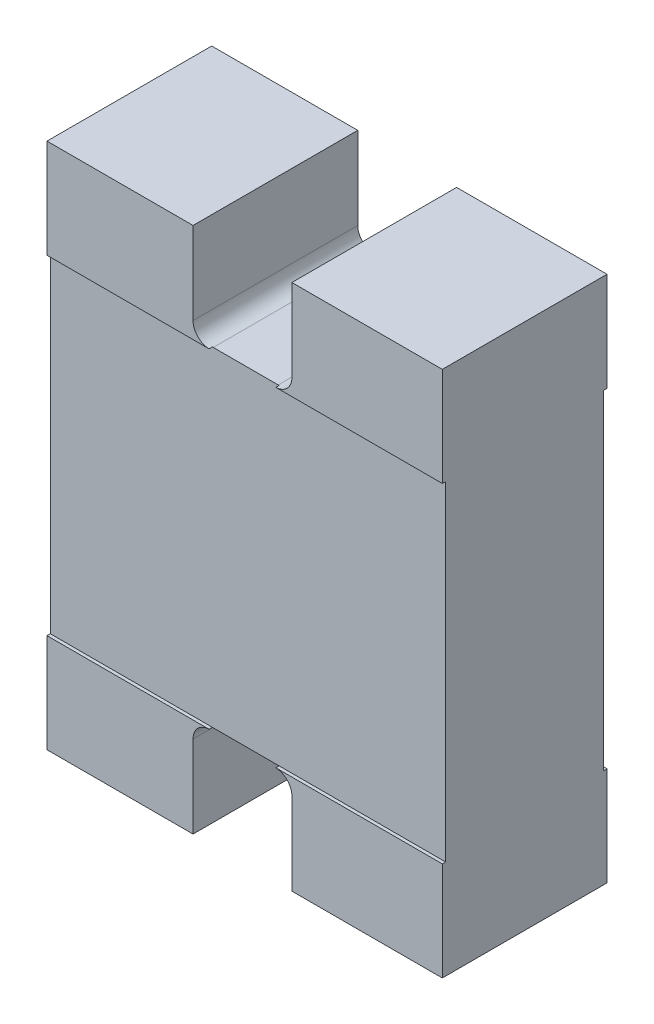
ISO-10303-21;
HEADER;
FILE_DESCRIPTION(('STEP AP214'),'2;1');
FILE_NAME('part.step','',(''),(''),'','','');
FILE_SCHEMA(('AUTOMOTIVE_DESIGN { 1 0 10303 214 1 1 1 1 }'));
ENDSEC;
DATA;
#1=APPLICATION_CONTEXT('core data for automotive mechanical design processes');
#2=APPLICATION_PROTOCOL_DEFINITION('international standard','automotive_design',2000,#1);
#3=PRODUCT_CONTEXT('',#1,'mechanical');
#4=PRODUCT('Part','Part','',(#3));
#5=PRODUCT_RELATED_PRODUCT_CATEGORY('part','',(#4));
#6=PRODUCT_DEFINITION_FORMATION('','',#4);
#7=PRODUCT_DEFINITION_CONTEXT('part definition',#1,'design');
#8=PRODUCT_DEFINITION('design','',#6,#7);
#9=PRODUCT_DEFINITION_SHAPE('','',#8);
#10=(LENGTH_UNIT() NAMED_UNIT(*) SI_UNIT(.MILLI.,.METRE.));
#11=(NAMED_UNIT(*) PLANE_ANGLE_UNIT() SI_UNIT($,.RADIAN.));
#12=(NAMED_UNIT(*) SI_UNIT($,.STERADIAN.) SOLID_ANGLE_UNIT());
#13=UNCERTAINTY_MEASURE_WITH_UNIT(LENGTH_MEASURE(1.E-05),#10,'distance_accuracy_value','');
#14=(GEOMETRIC_REPRESENTATION_CONTEXT(3) GLOBAL_UNCERTAINTY_ASSIGNED_CONTEXT((#13)) GLOBAL_UNIT_ASSIGNED_CONTEXT((#10,
#11,#12)) REPRESENTATION_CONTEXT('',''));
#15=CARTESIAN_POINT('',(0.,0.,0.));
#16=DIRECTION('',(0.,0.,1.));
#17=DIRECTION('',(1.,0.,0.));
#18=AXIS2_PLACEMENT_3D('',#15,#16,#17);
#19=CARTESIAN_POINT('',(0.,0.,0.5));
#20=DIRECTION('',(0.,0.,1.));
#21=DIRECTION('',(1.,0.,0.));
#22=AXIS2_PLACEMENT_3D('',#19,#20,#21);
#23=PLANE('',#22);
#24=DIRECTION('',(0.,1.,0.));
#25=VECTOR('',#24,1.);
#26=CARTESIAN_POINT('',(0.6,0.8,0.5));
#27=LINE('',#26,#25);
#28=CARTESIAN_POINT('',(0.6,-0.8,0.5));
#29=VERTEX_POINT('',#28);
#30=CARTESIAN_POINT('',(0.6,-0.500000000000838,0.5));
#31=VERTEX_POINT('',#30);
#32=EDGE_CURVE('E399',#29,#31,#27,.T.);
#33=ORIENTED_EDGE('',*,*,#32,.T.);
#34=DIRECTION('',(-1.,0.,0.));
#35=VECTOR('',#34,1.);
#36=CARTESIAN_POINT('',(0.6,-0.500000000000838,0.5));
#37=LINE('',#36,#35);
#38=CARTESIAN_POINT('',(0.0947676380211681,-0.500000000000838,0.5));
#39=VERTEX_POINT('',#38);
#40=EDGE_CURVE('E536',#31,#39,#37,.T.);
#41=ORIENTED_EDGE('',*,*,#40,.T.);
#42=CARTESIAN_POINT('',(0.0933814284328622,-0.549979938272866,0.5));
#43=DIRECTION('',(0.,0.,1.));
#44=DIRECTION('',(-1.,0.,0.));
#45=AXIS2_PLACEMENT_3D('',#42,#43,#44);
#46=CIRCLE('',#45,0.0499991580598961);
#47=CARTESIAN_POINT('',(0.143380586492758,-0.549979938272866,0.5));
#48=VERTEX_POINT('',#47);
#49=EDGE_CURVE('E527',#48,#39,#46,.T.);
#50=ORIENTED_EDGE('',*,*,#49,.F.);
#51=DIRECTION('',(-1.05897102086358E-06,0.999999999999439,0.));
#52=VECTOR('',#51,1.);
#53=CARTESIAN_POINT('',(0.143380851256758,-0.8,0.5));
#54=LINE('',#53,#52);
#55=CARTESIAN_POINT('',(0.143380851256758,-0.8,0.5));
#56=VERTEX_POINT('',#55);
#57=EDGE_CURVE('E121',#56,#48,#54,.T.);
#58=ORIENTED_EDGE('',*,*,#57,.F.);
#59=DIRECTION('',(1.,0.,0.));
#60=VECTOR('',#59,1.);
#61=CARTESIAN_POINT('',(-0.6,-0.8,0.5));
#62=LINE('',#61,#60);
#63=EDGE_CURVE('E408',#56,#29,#62,.T.);
#64=ORIENTED_EDGE('',*,*,#63,.T.);
#65=EDGE_LOOP('',(#33,#41,#50,#58,#64));
#66=FACE_BOUND('',#65,.T.);
#67=ADVANCED_FACE('F36',(#66),#23,.T.);
#68=CARTESIAN_POINT('',(-0.106619990683346,-0.549979938272866,0.5));
#69=DIRECTION('',(0.,0.,1.));
#70=DIRECTION('',(1.,0.,0.));
#71=AXIS2_PLACEMENT_3D('',#68,#69,#70);
#72=CIRCLE('',#71,0.0499991580598962);
#73=CARTESIAN_POINT('',(-0.108006200271658,-0.500000000000838,0.5));
#74=VERTEX_POINT('',#73);
#75=CARTESIAN_POINT('',(-0.156619148743242,-0.549979938272866,0.5));
#76=VERTEX_POINT('',#75);
#77=EDGE_CURVE('E525',#74,#76,#72,.T.);
#78=ORIENTED_EDGE('',*,*,#77,.F.);
#79=CARTESIAN_POINT('',(-0.6,-0.500000000000838,0.5));
#80=VERTEX_POINT('',#79);
#81=EDGE_CURVE('E422',#74,#80,#37,.T.);
#82=ORIENTED_EDGE('',*,*,#81,.T.);
#83=DIRECTION('',(0.,-1.,0.));
#84=VECTOR('',#83,1.);
#85=CARTESIAN_POINT('',(-0.6,0.8,0.5));
#86=LINE('',#85,#84);
#87=CARTESIAN_POINT('',(-0.6,-0.8,0.5));
#88=VERTEX_POINT('',#87);
#89=EDGE_CURVE('E405',#80,#88,#86,.T.);
#90=ORIENTED_EDGE('',*,*,#89,.T.);
#91=CARTESIAN_POINT('',(-0.156619148743242,-0.8,0.5));
#92=VERTEX_POINT('',#91);
#93=EDGE_CURVE('E193',#88,#92,#62,.T.);
#94=ORIENTED_EDGE('',*,*,#93,.T.);
#95=DIRECTION('',(0.,-1.,0.));
#96=VECTOR('',#95,1.);
#97=CARTESIAN_POINT('',(-0.156619148743242,-0.8,0.5));
#98=LINE('',#97,#96);
#99=EDGE_CURVE('E138',#76,#92,#98,.T.);
#100=ORIENTED_EDGE('',*,*,#99,.F.);
#101=EDGE_LOOP('',(#78,#82,#90,#94,#100));
#102=FACE_BOUND('',#101,.T.);
#103=ADVANCED_FACE('F418',(#102),#23,.T.);
#104=CARTESIAN_POINT('',(-0.6,0.8,0.5));
#105=VERTEX_POINT('',#104);
#106=CARTESIAN_POINT('',(-0.6,0.500000000000838,0.5));
#107=VERTEX_POINT('',#106);
#108=EDGE_CURVE('E406',#105,#107,#86,.T.);
#109=ORIENTED_EDGE('',*,*,#108,.T.);
#110=DIRECTION('',(1.,0.,0.));
#111=VECTOR('',#110,1.);
#112=CARTESIAN_POINT('',(0.6,0.500000000000838,0.5));
#113=LINE('',#112,#111);
#114=CARTESIAN_POINT('',(-0.108006200271662,0.500000000000838,0.5));
#115=VERTEX_POINT('',#114);
#116=EDGE_CURVE('E351',#107,#115,#113,.T.);
#117=ORIENTED_EDGE('',*,*,#116,.T.);
#118=CARTESIAN_POINT('',(-0.106619990683346,0.549979938272866,0.5));
#119=DIRECTION('',(0.,0.,-1.));
#120=DIRECTION('',(1.,0.,0.));
#121=AXIS2_PLACEMENT_3D('',#118,#119,#120);
#122=CIRCLE('',#121,0.0499991580598962);
#123=CARTESIAN_POINT('',(-0.156619148743242,0.549979938272866,0.5));
#124=VERTEX_POINT('',#123);
#125=EDGE_CURVE('E358',#115,#124,#122,.T.);
#126=ORIENTED_EDGE('',*,*,#125,.T.);
#127=DIRECTION('',(0.,1.,0.));
#128=VECTOR('',#127,1.);
#129=CARTESIAN_POINT('',(-0.156619148743242,0.8,0.5));
#130=LINE('',#129,#128);
#131=CARTESIAN_POINT('',(-0.156619148743242,0.8,0.5));
#132=VERTEX_POINT('',#131);
#133=EDGE_CURVE('E361',#124,#132,#130,.T.);
#134=ORIENTED_EDGE('',*,*,#133,.T.);
#135=DIRECTION('',(-1.,0.,0.));
#136=VECTOR('',#135,1.);
#137=CARTESIAN_POINT('',(-0.6,0.8,0.5));
#138=LINE('',#137,#136);
#139=EDGE_CURVE('E402',#132,#105,#138,.T.);
#140=ORIENTED_EDGE('',*,*,#139,.T.);
#141=EDGE_LOOP('',(#109,#117,#126,#134,#140));
#142=FACE_BOUND('',#141,.T.);
#143=ADVANCED_FACE('F613',(#142),#23,.T.);
#144=CARTESIAN_POINT('',(0.0933814284328622,0.549979938272866,0.5));
#145=DIRECTION('',(0.,0.,-1.));
#146=DIRECTION('',(-1.,0.,0.));
#147=AXIS2_PLACEMENT_3D('',#144,#145,#146);
#148=CIRCLE('',#147,0.0499991580598961);
#149=CARTESIAN_POINT('',(0.143380586492758,0.549979938272866,0.5));
#150=VERTEX_POINT('',#149);
#151=CARTESIAN_POINT('',(0.0947676380211722,0.500000000000838,0.5));
#152=VERTEX_POINT('',#151);
#153=EDGE_CURVE('E362',#150,#152,#148,.T.);
#154=ORIENTED_EDGE('',*,*,#153,.T.);
#155=CARTESIAN_POINT('',(0.6,0.500000000000838,0.5));
#156=VERTEX_POINT('',#155);
#157=EDGE_CURVE('E348',#152,#156,#113,.T.);
#158=ORIENTED_EDGE('',*,*,#157,.T.);
#159=CARTESIAN_POINT('',(0.6,0.8,0.5));
#160=VERTEX_POINT('',#159);
#161=EDGE_CURVE('E184',#156,#160,#27,.T.);
#162=ORIENTED_EDGE('',*,*,#161,.T.);
#163=CARTESIAN_POINT('',(0.143380851256758,0.8,0.5));
#164=VERTEX_POINT('',#163);
#165=EDGE_CURVE('E403',#160,#164,#138,.T.);
#166=ORIENTED_EDGE('',*,*,#165,.T.);
#167=DIRECTION('',(-1.05897102086358E-06,-0.999999999999439,0.));
#168=VECTOR('',#167,1.);
#169=CARTESIAN_POINT('',(0.143380851256758,0.8,0.5));
#170=LINE('',#169,#168);
#171=EDGE_CURVE('E232',#164,#150,#170,.T.);
#172=ORIENTED_EDGE('',*,*,#171,.T.);
#173=EDGE_LOOP('',(#154,#158,#162,#166,#172));
#174=FACE_BOUND('',#173,.T.);
#175=ADVANCED_FACE('F610',(#174),#23,.T.);
#176=CARTESIAN_POINT('',(0.091995218874762,0.5,0.5));
#177=DIRECTION('',(0.,-1.,0.));
#178=DIRECTION('',(0.,0.,-1.));
#179=AXIS2_PLACEMENT_3D('',#176,#177,#178);
#180=PLANE('',#179);
#181=DIRECTION('',(1.,0.,0.));
#182=VECTOR('',#181,1.);
#183=CARTESIAN_POINT('',(0.6,0.500000000000838,0.49));
#184=LINE('',#183,#182);
#185=CARTESIAN_POINT('',(-0.105233781110134,0.500000000000419,0.49));
#186=VERTEX_POINT('',#185);
#187=CARTESIAN_POINT('',(0.0919952188596571,0.500000000000419,0.49));
#188=VERTEX_POINT('',#187);
#189=EDGE_CURVE('E384',#186,#188,#184,.T.);
#190=ORIENTED_EDGE('',*,*,#189,.T.);
#191=DIRECTION('',(0.,0.,-1.));
#192=VECTOR('',#191,1.);
#193=CARTESIAN_POINT('',(0.091995218874762,0.5,0.5));
#194=LINE('',#193,#192);
#195=CARTESIAN_POINT('',(0.0919952188596571,0.500000000000419,0.01));
#196=VERTEX_POINT('',#195);
#197=EDGE_CURVE('E386',#188,#196,#194,.T.);
#198=ORIENTED_EDGE('',*,*,#197,.T.);
#199=DIRECTION('',(1.,0.,0.));
#200=VECTOR('',#199,1.);
#201=CARTESIAN_POINT('',(0.6,0.500000000000838,0.01));
#202=LINE('',#201,#200);
#203=CARTESIAN_POINT('',(-0.105233781110134,0.500000000000419,0.01));
#204=VERTEX_POINT('',#203);
#205=EDGE_CURVE('E256',#204,#196,#202,.T.);
#206=ORIENTED_EDGE('',*,*,#205,.F.);
#207=DIRECTION('',(0.,0.,-1.));
#208=VECTOR('',#207,1.);
#209=CARTESIAN_POINT('',(-0.105233781125238,0.5,0.5));
#210=LINE('',#209,#208);
#211=EDGE_CURVE('E377',#186,#204,#210,.T.);
#212=ORIENTED_EDGE('',*,*,#211,.F.);
#213=EDGE_LOOP('',(#190,#198,#206,#212));
#214=FACE_BOUND('',#213,.T.);
#215=ADVANCED_FACE('F382',(#214),#180,.F.);
#216=CARTESIAN_POINT('',(0.6,0.8,0.5));
#217=DIRECTION('',(-1.,0.,0.));
#218=DIRECTION('',(0.,-1.,0.));
#219=AXIS2_PLACEMENT_3D('',#216,#217,#218);
#220=PLANE('',#219);
#221=DIRECTION('',(0.,0.,1.));
#222=VECTOR('',#221,1.);
#223=CARTESIAN_POINT('',(0.6,-0.500000000000838,0.49));
#224=LINE('',#223,#222);
#225=CARTESIAN_POINT('',(0.6,-0.500000000000838,0.49));
#226=VERTEX_POINT('',#225);
#227=EDGE_CURVE('E367',#226,#31,#224,.T.);
#228=ORIENTED_EDGE('',*,*,#227,.T.);
#229=ORIENTED_EDGE('',*,*,#32,.F.);
#230=DIRECTION('',(0.,0.,-1.));
#231=VECTOR('',#230,1.);
#232=CARTESIAN_POINT('',(0.6,-0.8,0.5));
#233=LINE('',#232,#231);
#234=CARTESIAN_POINT('',(0.6,-0.8,0.));
#235=VERTEX_POINT('',#234);
#236=EDGE_CURVE('E190',#29,#235,#233,.T.);
#237=ORIENTED_EDGE('',*,*,#236,.T.);
#238=DIRECTION('',(0.,1.,0.));
#239=VECTOR('',#238,1.);
#240=CARTESIAN_POINT('',(0.6,0.8,0.));
#241=LINE('',#240,#239);
#242=CARTESIAN_POINT('',(0.6,-0.500000000000838,0.));
#243=VERTEX_POINT('',#242);
#244=EDGE_CURVE('E174',#235,#243,#241,.T.);
#245=ORIENTED_EDGE('',*,*,#244,.T.);
#246=DIRECTION('',(0.,0.,-1.));
#247=VECTOR('',#246,1.);
#248=CARTESIAN_POINT('',(0.6,-0.500000000000838,0.01));
#249=LINE('',#248,#247);
#250=CARTESIAN_POINT('',(0.6,-0.500000000000838,0.01));
#251=VERTEX_POINT('',#250);
#252=EDGE_CURVE('E248',#251,#243,#249,.T.);
#253=ORIENTED_EDGE('',*,*,#252,.F.);
#254=DIRECTION('',(0.,-1.,0.));
#255=VECTOR('',#254,1.);
#256=CARTESIAN_POINT('',(0.6,0.500000000000838,0.01));
#257=LINE('',#256,#255);
#258=CARTESIAN_POINT('',(0.6,0.500000000000838,0.01));
#259=VERTEX_POINT('',#258);
#260=EDGE_CURVE('E231',#259,#251,#257,.T.);
#261=ORIENTED_EDGE('',*,*,#260,.F.);
#262=DIRECTION('',(0.,0.,-1.));
#263=VECTOR('',#262,1.);
#264=CARTESIAN_POINT('',(0.6,0.500000000000838,0.01));
#265=LINE('',#264,#263);
#266=CARTESIAN_POINT('',(0.6,0.500000000000838,0.));
#267=VERTEX_POINT('',#266);
#268=EDGE_CURVE('E239',#259,#267,#265,.T.);
#269=ORIENTED_EDGE('',*,*,#268,.T.);
#270=CARTESIAN_POINT('',(0.6,0.8,0.));
#271=VERTEX_POINT('',#270);
#272=EDGE_CURVE('E295',#267,#271,#241,.T.);
#273=ORIENTED_EDGE('',*,*,#272,.T.);
#274=DIRECTION('',(0.,0.,-1.));
#275=VECTOR('',#274,1.);
#276=CARTESIAN_POINT('',(0.6,0.8,0.5));
#277=LINE('',#276,#275);
#278=EDGE_CURVE('E199',#160,#271,#277,.T.);
#279=ORIENTED_EDGE('',*,*,#278,.F.);
#280=ORIENTED_EDGE('',*,*,#161,.F.);
#281=DIRECTION('',(0.,0.,1.));
#282=VECTOR('',#281,1.);
#283=CARTESIAN_POINT('',(0.6,0.500000000000838,0.49));
#284=LINE('',#283,#282);
#285=CARTESIAN_POINT('',(0.6,0.500000000000838,0.49));
#286=VERTEX_POINT('',#285);
#287=EDGE_CURVE('E547',#286,#156,#284,.T.);
#288=ORIENTED_EDGE('',*,*,#287,.F.);
#289=DIRECTION('',(0.,-1.,0.));
#290=VECTOR('',#289,1.);
#291=CARTESIAN_POINT('',(0.6,0.500000000000838,0.49));
#292=LINE('',#291,#290);
#293=EDGE_CURVE('E538',#286,#226,#292,.T.);
#294=ORIENTED_EDGE('',*,*,#293,.T.);
#295=EDGE_LOOP('',(#228,#229,#237,#245,#253,#261,#269,#273,#279,#280,#288,#294));
#296=FACE_BOUND('',#295,.T.);
#297=ADVANCED_FACE('F38',(#296),#220,.F.);
#298=CARTESIAN_POINT('',(-0.6,0.8,0.5));
#299=DIRECTION('',(1.,0.,0.));
#300=DIRECTION('',(0.,1.,0.));
#301=AXIS2_PLACEMENT_3D('',#298,#299,#300);
#302=PLANE('',#301);
#303=DIRECTION('',(0.,0.,1.));
#304=VECTOR('',#303,1.);
#305=CARTESIAN_POINT('',(-0.6,-0.500000000000838,0.49));
#306=LINE('',#305,#304);
#307=CARTESIAN_POINT('',(-0.6,-0.500000000000838,0.49));
#308=VERTEX_POINT('',#307);
#309=EDGE_CURVE('E429',#308,#80,#306,.T.);
#310=ORIENTED_EDGE('',*,*,#309,.F.);
#311=DIRECTION('',(0.,1.,0.));
#312=VECTOR('',#311,1.);
#313=CARTESIAN_POINT('',(-0.6,0.500000000000838,0.49));
#314=LINE('',#313,#312);
#315=CARTESIAN_POINT('',(-0.6,0.500000000000838,0.49));
#316=VERTEX_POINT('',#315);
#317=EDGE_CURVE('E558',#308,#316,#314,.T.);
#318=ORIENTED_EDGE('',*,*,#317,.T.);
#319=DIRECTION('',(0.,0.,1.));
#320=VECTOR('',#319,1.);
#321=CARTESIAN_POINT('',(-0.6,0.500000000000838,0.49));
#322=LINE('',#321,#320);
#323=EDGE_CURVE('E545',#316,#107,#322,.T.);
#324=ORIENTED_EDGE('',*,*,#323,.T.);
#325=ORIENTED_EDGE('',*,*,#108,.F.);
#326=DIRECTION('',(0.,0.,-1.));
#327=VECTOR('',#326,1.);
#328=CARTESIAN_POINT('',(-0.6,0.8,0.5));
#329=LINE('',#328,#327);
#330=CARTESIAN_POINT('',(-0.6,0.8,0.));
#331=VERTEX_POINT('',#330);
#332=EDGE_CURVE('E196',#105,#331,#329,.T.);
#333=ORIENTED_EDGE('',*,*,#332,.T.);
#334=DIRECTION('',(0.,-1.,0.));
#335=VECTOR('',#334,1.);
#336=CARTESIAN_POINT('',(-0.6,0.8,0.));
#337=LINE('',#336,#335);
#338=CARTESIAN_POINT('',(-0.6,0.500000000000838,0.));
#339=VERTEX_POINT('',#338);
#340=EDGE_CURVE('E181',#331,#339,#337,.T.);
#341=ORIENTED_EDGE('',*,*,#340,.T.);
#342=DIRECTION('',(0.,0.,-1.));
#343=VECTOR('',#342,1.);
#344=CARTESIAN_POINT('',(-0.6,0.500000000000838,0.01));
#345=LINE('',#344,#343);
#346=CARTESIAN_POINT('',(-0.6,0.500000000000838,0.01));
#347=VERTEX_POINT('',#346);
#348=EDGE_CURVE('E243',#347,#339,#345,.T.);
#349=ORIENTED_EDGE('',*,*,#348,.F.);
#350=DIRECTION('',(0.,1.,0.));
#351=VECTOR('',#350,1.);
#352=CARTESIAN_POINT('',(-0.6,0.500000000000838,0.01));
#353=LINE('',#352,#351);
#354=CARTESIAN_POINT('',(-0.6,-0.500000000000838,0.01));
#355=VERTEX_POINT('',#354);
#356=EDGE_CURVE('E267',#355,#347,#353,.T.);
#357=ORIENTED_EDGE('',*,*,#356,.F.);
#358=DIRECTION('',(0.,0.,-1.));
#359=VECTOR('',#358,1.);
#360=CARTESIAN_POINT('',(-0.6,-0.500000000000838,0.01));
#361=LINE('',#360,#359);
#362=CARTESIAN_POINT('',(-0.6,-0.500000000000838,0.));
#363=VERTEX_POINT('',#362);
#364=EDGE_CURVE('E246',#355,#363,#361,.T.);
#365=ORIENTED_EDGE('',*,*,#364,.T.);
#366=CARTESIAN_POINT('',(-0.6,-0.8,0.));
#367=VERTEX_POINT('',#366);
#368=EDGE_CURVE('E186',#363,#367,#337,.T.);
#369=ORIENTED_EDGE('',*,*,#368,.T.);
#370=DIRECTION('',(0.,0.,-1.));
#371=VECTOR('',#370,1.);
#372=CARTESIAN_POINT('',(-0.6,-0.8,0.5));
#373=LINE('',#372,#371);
#374=EDGE_CURVE('E192',#88,#367,#373,.T.);
#375=ORIENTED_EDGE('',*,*,#374,.F.);
#376=ORIENTED_EDGE('',*,*,#89,.F.);
#377=EDGE_LOOP('',(#310,#318,#324,#325,#333,#341,#349,#357,#365,#369,#375,#376));
#378=FACE_BOUND('',#377,.T.);
#379=ADVANCED_FACE('F314',(#378),#302,.F.);
#380=CARTESIAN_POINT('',(-0.106619990683346,0.549979938272866,0.5));
#381=DIRECTION('',(0.,0.,-1.));
#382=DIRECTION('',(-1.,0.,0.));
#383=AXIS2_PLACEMENT_3D('',#380,#381,#382);
#384=CYLINDRICAL_SURFACE('',#383,0.0499991580598962);
#385=DIRECTION('',(0.,0.,-1.));
#386=VECTOR('',#385,1.);
#387=CARTESIAN_POINT('',(-0.108006200271662,0.500000000000838,0.5));
#388=LINE('',#387,#386);
#389=CARTESIAN_POINT('',(-0.108006200271662,0.500000000000838,0.49));
#390=VERTEX_POINT('',#389);
#391=EDGE_CURVE('E334',#390,#115,#388,.F.);
#392=ORIENTED_EDGE('',*,*,#391,.F.);
#393=CARTESIAN_POINT('',(-0.106619990683346,0.549979938272866,0.49));
#394=DIRECTION('',(0.,0.,-1.));
#395=DIRECTION('',(-1.,0.,0.));
#396=AXIS2_PLACEMENT_3D('',#393,#394,#395);
#397=CIRCLE('',#396,0.0499991580598962);
#398=EDGE_CURVE('E40',#390,#186,#397,.F.);
#399=ORIENTED_EDGE('',*,*,#398,.T.);
#400=ORIENTED_EDGE('',*,*,#211,.T.);
#401=CARTESIAN_POINT('',(-0.106619990683346,0.549979938272866,0.01));
#402=DIRECTION('',(0.,0.,-1.));
#403=DIRECTION('',(-1.,0.,0.));
#404=AXIS2_PLACEMENT_3D('',#401,#402,#403);
#405=CIRCLE('',#404,0.0499991580598962);
#406=CARTESIAN_POINT('',(-0.108006200271662,0.500000000000838,0.01));
#407=VERTEX_POINT('',#406);
#408=EDGE_CURVE('E224',#407,#204,#405,.F.);
#409=ORIENTED_EDGE('',*,*,#408,.F.);
#410=DIRECTION('',(0.,0.,-1.));
#411=VECTOR('',#410,1.);
#412=CARTESIAN_POINT('',(-0.108006200271662,0.500000000000838,0.5));
#413=LINE('',#412,#411);
#414=CARTESIAN_POINT('',(-0.108006200271662,0.500000000000838,0.));
#415=VERTEX_POINT('',#414);
#416=EDGE_CURVE('E220',#407,#415,#413,.T.);
#417=ORIENTED_EDGE('',*,*,#416,.T.);
#418=CARTESIAN_POINT('',(-0.106619990683346,0.549979938272866,0.));
#419=DIRECTION('',(0.,0.,-1.));
#420=DIRECTION('',(1.,0.,0.));
#421=AXIS2_PLACEMENT_3D('',#418,#419,#420);
#422=CIRCLE('',#421,0.0499991580598962);
#423=CARTESIAN_POINT('',(-0.156619148743242,0.549979938272866,0.));
#424=VERTEX_POINT('',#423);
#425=EDGE_CURVE('E212',#415,#424,#422,.T.);
#426=ORIENTED_EDGE('',*,*,#425,.T.);
#427=DIRECTION('',(0.,0.,-1.));
#428=VECTOR('',#427,1.);
#429=CARTESIAN_POINT('',(-0.156619148743242,0.549979938272866,0.5));
#430=LINE('',#429,#428);
#431=EDGE_CURVE('E385',#124,#424,#430,.T.);
#432=ORIENTED_EDGE('',*,*,#431,.F.);
#433=ORIENTED_EDGE('',*,*,#125,.F.);
#434=EDGE_LOOP('',(#392,#399,#400,#409,#417,#426,#432,#433));
#435=FACE_BOUND('',#434,.T.);
#436=ADVANCED_FACE('F375',(#435),#384,.F.);
#437=CARTESIAN_POINT('',(0.0933814284328622,0.549979938272866,0.5));
#438=DIRECTION('',(0.,0.,-1.));
#439=DIRECTION('',(-1.,0.,0.));
#440=AXIS2_PLACEMENT_3D('',#437,#438,#439);
#441=CYLINDRICAL_SURFACE('',#440,0.0499991580598961);
#442=DIRECTION('',(0.,0.,-1.));
#443=VECTOR('',#442,1.);
#444=CARTESIAN_POINT('',(0.0947676380211722,0.500000000000838,0.5));
#445=LINE('',#444,#443);
#446=CARTESIAN_POINT('',(0.0947676380211722,0.500000000000838,0.49));
#447=VERTEX_POINT('',#446);
#448=EDGE_CURVE('E11',#152,#447,#445,.T.);
#449=ORIENTED_EDGE('',*,*,#448,.F.);
#450=ORIENTED_EDGE('',*,*,#153,.F.);
#451=DIRECTION('',(0.,0.,-1.));
#452=VECTOR('',#451,1.);
#453=CARTESIAN_POINT('',(0.143380586492758,0.549979938272866,0.5));
#454=LINE('',#453,#452);
#455=CARTESIAN_POINT('',(0.143380586492758,0.549979938272866,0.));
#456=VERTEX_POINT('',#455);
#457=EDGE_CURVE('E390',#150,#456,#454,.T.);
#458=ORIENTED_EDGE('',*,*,#457,.T.);
#459=CARTESIAN_POINT('',(0.0933814284328622,0.549979938272866,0.));
#460=DIRECTION('',(0.,0.,-1.));
#461=DIRECTION('',(-1.,0.,0.));
#462=AXIS2_PLACEMENT_3D('',#459,#460,#461);
#463=CIRCLE('',#462,0.0499991580598961);
#464=CARTESIAN_POINT('',(0.0947676380211722,0.500000000000838,0.));
#465=VERTEX_POINT('',#464);
#466=EDGE_CURVE('E209',#456,#465,#463,.T.);
#467=ORIENTED_EDGE('',*,*,#466,.T.);
#468=DIRECTION('',(0.,0.,-1.));
#469=VECTOR('',#468,1.);
#470=CARTESIAN_POINT('',(0.0947676380211722,0.500000000000838,0.5));
#471=LINE('',#470,#469);
#472=CARTESIAN_POINT('',(0.0947676380211722,0.500000000000838,0.01));
#473=VERTEX_POINT('',#472);
#474=EDGE_CURVE('E205',#465,#473,#471,.F.);
#475=ORIENTED_EDGE('',*,*,#474,.T.);
#476=CARTESIAN_POINT('',(0.0933814284328622,0.549979938272866,0.01));
#477=DIRECTION('',(0.,0.,-1.));
#478=DIRECTION('',(-1.,0.,0.));
#479=AXIS2_PLACEMENT_3D('',#476,#477,#478);
#480=CIRCLE('',#479,0.0499991580598961);
#481=EDGE_CURVE('E202',#196,#473,#480,.F.);
#482=ORIENTED_EDGE('',*,*,#481,.F.);
#483=ORIENTED_EDGE('',*,*,#197,.F.);
#484=CARTESIAN_POINT('',(0.0933814284328622,0.549979938272866,0.49));
#485=DIRECTION('',(0.,0.,-1.));
#486=DIRECTION('',(-1.,0.,0.));
#487=AXIS2_PLACEMENT_3D('',#484,#485,#486);
#488=CIRCLE('',#487,0.0499991580598961);
#489=EDGE_CURVE('E366',#188,#447,#488,.F.);
#490=ORIENTED_EDGE('',*,*,#489,.T.);
#491=EDGE_LOOP('',(#449,#450,#458,#467,#475,#482,#483,#490));
#492=FACE_BOUND('',#491,.T.);
#493=ADVANCED_FACE('F815',(#492),#441,.F.);
#494=CARTESIAN_POINT('',(0.0933814284328622,-0.549979938272866,0.5));
#495=DIRECTION('',(0.,0.,-1.));
#496=DIRECTION('',(-1.,0.,0.));
#497=AXIS2_PLACEMENT_3D('',#494,#495,#496);
#498=CYLINDRICAL_SURFACE('',#497,0.0499991580598961);
#499=ORIENTED_EDGE('',*,*,#49,.T.);
#500=DIRECTION('',(0.,0.,-1.));
#501=VECTOR('',#500,1.);
#502=CARTESIAN_POINT('',(0.0947676380211681,-0.500000000000838,0.5));
#503=LINE('',#502,#501);
#504=CARTESIAN_POINT('',(0.0947676380211682,-0.500000000000838,0.49));
#505=VERTEX_POINT('',#504);
#506=EDGE_CURVE('E336',#39,#505,#503,.T.);
#507=ORIENTED_EDGE('',*,*,#506,.T.);
#508=CARTESIAN_POINT('',(0.0933814284328622,-0.549979938272866,0.49));
#509=DIRECTION('',(0.,0.,-1.));
#510=DIRECTION('',(-1.,0.,0.));
#511=AXIS2_PLACEMENT_3D('',#508,#509,#510);
#512=CIRCLE('',#511,0.0499991580598961);
#513=CARTESIAN_POINT('',(0.0919952188596591,-0.500000000000419,0.49));
#514=VERTEX_POINT('',#513);
#515=EDGE_CURVE('E365',#505,#514,#512,.F.);
#516=ORIENTED_EDGE('',*,*,#515,.T.);
#517=DIRECTION('',(0.,0.,-1.));
#518=VECTOR('',#517,1.);
#519=CARTESIAN_POINT('',(0.091995218874762,-0.5,0.5));
#520=LINE('',#519,#518);
#521=CARTESIAN_POINT('',(0.0919952188596591,-0.500000000000419,0.01));
#522=VERTEX_POINT('',#521);
#523=EDGE_CURVE('E102',#514,#522,#520,.T.);
#524=ORIENTED_EDGE('',*,*,#523,.T.);
#525=CARTESIAN_POINT('',(0.0933814284328622,-0.549979938272866,0.01));
#526=DIRECTION('',(0.,0.,-1.));
#527=DIRECTION('',(-1.,0.,0.));
#528=AXIS2_PLACEMENT_3D('',#525,#526,#527);
#529=CIRCLE('',#528,0.0499991580598961);
#530=CARTESIAN_POINT('',(0.0947676380211682,-0.500000000000838,0.01));
#531=VERTEX_POINT('',#530);
#532=EDGE_CURVE('E512',#531,#522,#529,.F.);
#533=ORIENTED_EDGE('',*,*,#532,.F.);
#534=DIRECTION('',(0.,0.,-1.));
#535=VECTOR('',#534,1.);
#536=CARTESIAN_POINT('',(0.0947676380211681,-0.500000000000838,0.5));
#537=LINE('',#536,#535);
#538=CARTESIAN_POINT('',(0.0947676380211681,-0.500000000000838,0.));
#539=VERTEX_POINT('',#538);
#540=EDGE_CURVE('E91',#531,#539,#537,.T.);
#541=ORIENTED_EDGE('',*,*,#540,.T.);
#542=CARTESIAN_POINT('',(0.0933814284328622,-0.549979938272866,0.));
#543=DIRECTION('',(0.,0.,1.));
#544=DIRECTION('',(-1.,0.,0.));
#545=AXIS2_PLACEMENT_3D('',#542,#543,#544);
#546=CIRCLE('',#545,0.0499991580598961);
#547=CARTESIAN_POINT('',(0.143380586492758,-0.549979938272866,0.));
#548=VERTEX_POINT('',#547);
#549=EDGE_CURVE('E126',#548,#539,#546,.T.);
#550=ORIENTED_EDGE('',*,*,#549,.F.);
#551=DIRECTION('',(0.,0.,-1.));
#552=VECTOR('',#551,1.);
#553=CARTESIAN_POINT('',(0.143380586492758,-0.549979938272866,0.5));
#554=LINE('',#553,#552);
#555=EDGE_CURVE('E112',#48,#548,#554,.T.);
#556=ORIENTED_EDGE('',*,*,#555,.F.);
#557=EDGE_LOOP('',(#499,#507,#516,#524,#533,#541,#550,#556));
#558=FACE_BOUND('',#557,.T.);
#559=ADVANCED_FACE('F160',(#558),#498,.F.);
#560=CARTESIAN_POINT('',(0.091995218874762,-0.5,0.5));
#561=DIRECTION('',(0.,-1.,0.));
#562=DIRECTION('',(0.,0.,-1.));
#563=AXIS2_PLACEMENT_3D('',#560,#561,#562);
#564=PLANE('',#563);
#565=ORIENTED_EDGE('',*,*,#523,.F.);
#566=DIRECTION('',(-1.,0.,0.));
#567=VECTOR('',#566,1.);
#568=CARTESIAN_POINT('',(0.6,-0.500000000000838,0.49));
#569=LINE('',#568,#567);
#570=CARTESIAN_POINT('',(-0.105233781110136,-0.500000000000419,0.49));
#571=VERTEX_POINT('',#570);
#572=EDGE_CURVE('E86',#514,#571,#569,.T.);
#573=ORIENTED_EDGE('',*,*,#572,.T.);
#574=DIRECTION('',(0.,0.,-1.));
#575=VECTOR('',#574,1.);
#576=CARTESIAN_POINT('',(-0.105233781125238,-0.5,0.5));
#577=LINE('',#576,#575);
#578=CARTESIAN_POINT('',(-0.105233781110136,-0.500000000000419,0.01));
#579=VERTEX_POINT('',#578);
#580=EDGE_CURVE('E99',#571,#579,#577,.T.);
#581=ORIENTED_EDGE('',*,*,#580,.T.);
#582=DIRECTION('',(-1.,0.,0.));
#583=VECTOR('',#582,1.);
#584=CARTESIAN_POINT('',(0.6,-0.500000000000838,0.01));
#585=LINE('',#584,#583);
#586=EDGE_CURVE('E278',#522,#579,#585,.T.);
#587=ORIENTED_EDGE('',*,*,#586,.F.);
#588=EDGE_LOOP('',(#565,#573,#581,#587));
#589=FACE_BOUND('',#588,.T.);
#590=ADVANCED_FACE('F96',(#589),#564,.T.);
#591=CARTESIAN_POINT('',(-0.106619990683346,-0.549979938272866,0.5));
#592=DIRECTION('',(0.,0.,-1.));
#593=DIRECTION('',(-1.,0.,0.));
#594=AXIS2_PLACEMENT_3D('',#591,#592,#593);
#595=CYLINDRICAL_SURFACE('',#594,0.0499991580598962);
#596=CARTESIAN_POINT('',(-0.106619990683346,-0.549979938272866,0.49));
#597=DIRECTION('',(0.,0.,-1.));
#598=DIRECTION('',(-1.,0.,0.));
#599=AXIS2_PLACEMENT_3D('',#596,#597,#598);
#600=CIRCLE('',#599,0.0499991580598962);
#601=CARTESIAN_POINT('',(-0.108006200271658,-0.500000000000838,0.49));
#602=VERTEX_POINT('',#601);
#603=EDGE_CURVE('E83',#571,#602,#600,.F.);
#604=ORIENTED_EDGE('',*,*,#603,.T.);
#605=DIRECTION('',(0.,0.,-1.));
#606=VECTOR('',#605,1.);
#607=CARTESIAN_POINT('',(-0.108006200271658,-0.500000000000838,0.5));
#608=LINE('',#607,#606);
#609=EDGE_CURVE('E46',#602,#74,#608,.F.);
#610=ORIENTED_EDGE('',*,*,#609,.T.);
#611=ORIENTED_EDGE('',*,*,#77,.T.);
#612=DIRECTION('',(0.,0.,-1.));
#613=VECTOR('',#612,1.);
#614=CARTESIAN_POINT('',(-0.156619148743242,-0.549979938272866,0.5));
#615=LINE('',#614,#613);
#616=CARTESIAN_POINT('',(-0.156619148743242,-0.549979938272866,0.));
#617=VERTEX_POINT('',#616);
#618=EDGE_CURVE('E110',#76,#617,#615,.T.);
#619=ORIENTED_EDGE('',*,*,#618,.T.);
#620=CARTESIAN_POINT('',(-0.106619990683346,-0.549979938272866,0.));
#621=DIRECTION('',(0.,0.,1.));
#622=DIRECTION('',(1.,0.,0.));
#623=AXIS2_PLACEMENT_3D('',#620,#621,#622);
#624=CIRCLE('',#623,0.0499991580598962);
#625=CARTESIAN_POINT('',(-0.108006200271658,-0.500000000000838,0.));
#626=VERTEX_POINT('',#625);
#627=EDGE_CURVE('E122',#626,#617,#624,.T.);
#628=ORIENTED_EDGE('',*,*,#627,.F.);
#629=DIRECTION('',(0.,0.,-1.));
#630=VECTOR('',#629,1.);
#631=CARTESIAN_POINT('',(-0.108006200271658,-0.500000000000838,0.5));
#632=LINE('',#631,#630);
#633=CARTESIAN_POINT('',(-0.108006200271658,-0.500000000000838,0.01));
#634=VERTEX_POINT('',#633);
#635=EDGE_CURVE('E208',#626,#634,#632,.F.);
#636=ORIENTED_EDGE('',*,*,#635,.T.);
#637=CARTESIAN_POINT('',(-0.106619990683346,-0.549979938272866,0.01));
#638=DIRECTION('',(0.,0.,-1.));
#639=DIRECTION('',(-1.,0.,0.));
#640=AXIS2_PLACEMENT_3D('',#637,#638,#639);
#641=CIRCLE('',#640,0.0499991580598962);
#642=EDGE_CURVE('E108',#579,#634,#641,.F.);
#643=ORIENTED_EDGE('',*,*,#642,.F.);
#644=ORIENTED_EDGE('',*,*,#580,.F.);
#645=EDGE_LOOP('',(#604,#610,#611,#619,#628,#636,#643,#644));
#646=FACE_BOUND('',#645,.T.);
#647=ADVANCED_FACE('F105',(#646),#595,.F.);
#648=CARTESIAN_POINT('',(-0.6,-0.8,0.5));
#649=DIRECTION('',(0.,1.,0.));
#650=DIRECTION('',(0.,0.,1.));
#651=AXIS2_PLACEMENT_3D('',#648,#649,#650);
#652=PLANE('',#651);
#653=DIRECTION('',(0.,0.,-1.));
#654=VECTOR('',#653,1.);
#655=CARTESIAN_POINT('',(0.143380851256758,-0.8,0.5));
#656=LINE('',#655,#654);
#657=CARTESIAN_POINT('',(0.143380851256758,-0.8,0.));
#658=VERTEX_POINT('',#657);
#659=EDGE_CURVE('E139',#56,#658,#656,.T.);
#660=ORIENTED_EDGE('',*,*,#659,.T.);
#661=DIRECTION('',(1.,0.,0.));
#662=VECTOR('',#661,1.);
#663=CARTESIAN_POINT('',(-0.6,-0.8,0.));
#664=LINE('',#663,#662);
#665=EDGE_CURVE('E171',#658,#235,#664,.T.);
#666=ORIENTED_EDGE('',*,*,#665,.T.);
#667=ORIENTED_EDGE('',*,*,#236,.F.);
#668=ORIENTED_EDGE('',*,*,#63,.F.);
#669=EDGE_LOOP('',(#660,#666,#667,#668));
#670=FACE_BOUND('',#669,.T.);
#671=ADVANCED_FACE('F733',(#670),#652,.F.);
#672=DIRECTION('',(0.,0.,-1.));
#673=VECTOR('',#672,1.);
#674=CARTESIAN_POINT('',(-0.156619148743242,-0.8,0.5));
#675=LINE('',#674,#673);
#676=CARTESIAN_POINT('',(-0.156619148743242,-0.8,0.));
#677=VERTEX_POINT('',#676);
#678=EDGE_CURVE('E115',#92,#677,#675,.T.);
#679=ORIENTED_EDGE('',*,*,#678,.F.);
#680=ORIENTED_EDGE('',*,*,#93,.F.);
#681=ORIENTED_EDGE('',*,*,#374,.T.);
#682=EDGE_CURVE('E180',#367,#677,#664,.T.);
#683=ORIENTED_EDGE('',*,*,#682,.T.);
#684=EDGE_LOOP('',(#679,#680,#681,#683));
#685=FACE_BOUND('',#684,.T.);
#686=ADVANCED_FACE('F326',(#685),#652,.F.);
#687=CARTESIAN_POINT('',(0.,0.,0.));
#688=DIRECTION('',(0.,0.,1.));
#689=DIRECTION('',(1.,0.,0.));
#690=AXIS2_PLACEMENT_3D('',#687,#688,#689);
#691=PLANE('',#690);
#692=DIRECTION('',(-1.05897102086358E-06,0.999999999999439,0.));
#693=VECTOR('',#692,1.);
#694=CARTESIAN_POINT('',(0.143380851256758,-0.8,0.));
#695=LINE('',#694,#693);
#696=EDGE_CURVE('E135',#658,#548,#695,.T.);
#697=ORIENTED_EDGE('',*,*,#696,.T.);
#698=ORIENTED_EDGE('',*,*,#549,.T.);
#699=DIRECTION('',(-1.,0.,0.));
#700=VECTOR('',#699,1.);
#701=CARTESIAN_POINT('',(0.6,-0.500000000000838,0.));
#702=LINE('',#701,#700);
#703=EDGE_CURVE('E515',#243,#539,#702,.T.);
#704=ORIENTED_EDGE('',*,*,#703,.F.);
#705=ORIENTED_EDGE('',*,*,#244,.F.);
#706=ORIENTED_EDGE('',*,*,#665,.F.);
#707=EDGE_LOOP('',(#697,#698,#704,#705,#706));
#708=FACE_BOUND('',#707,.T.);
#709=ADVANCED_FACE('F168',(#708),#691,.F.);
#710=ORIENTED_EDGE('',*,*,#627,.T.);
#711=DIRECTION('',(0.,-1.,0.));
#712=VECTOR('',#711,1.);
#713=CARTESIAN_POINT('',(-0.156619148743242,-0.8,0.));
#714=LINE('',#713,#712);
#715=EDGE_CURVE('E127',#617,#677,#714,.T.);
#716=ORIENTED_EDGE('',*,*,#715,.T.);
#717=ORIENTED_EDGE('',*,*,#682,.F.);
#718=ORIENTED_EDGE('',*,*,#368,.F.);
#719=EDGE_CURVE('E513',#626,#363,#702,.T.);
#720=ORIENTED_EDGE('',*,*,#719,.F.);
#721=EDGE_LOOP('',(#710,#716,#717,#718,#720));
#722=FACE_BOUND('',#721,.T.);
#723=ADVANCED_FACE('F329',(#722),#691,.F.);
#724=CARTESIAN_POINT('',(0.,0.,0.01));
#725=DIRECTION('',(0.,0.,-1.));
#726=DIRECTION('',(-1.,0.,0.));
#727=AXIS2_PLACEMENT_3D('',#724,#725,#726);
#728=PLANE('',#727);
#729=EDGE_CURVE('E273',#251,#531,#585,.T.);
#730=ORIENTED_EDGE('',*,*,#729,.T.);
#731=ORIENTED_EDGE('',*,*,#532,.T.);
#732=ORIENTED_EDGE('',*,*,#586,.T.);
#733=ORIENTED_EDGE('',*,*,#642,.T.);
#734=EDGE_CURVE('E280',#634,#355,#585,.T.);
#735=ORIENTED_EDGE('',*,*,#734,.T.);
#736=ORIENTED_EDGE('',*,*,#356,.T.);
#737=EDGE_CURVE('E250',#347,#407,#202,.T.);
#738=ORIENTED_EDGE('',*,*,#737,.T.);
#739=ORIENTED_EDGE('',*,*,#408,.T.);
#740=ORIENTED_EDGE('',*,*,#205,.T.);
#741=ORIENTED_EDGE('',*,*,#481,.T.);
#742=EDGE_CURVE('E257',#473,#259,#202,.T.);
#743=ORIENTED_EDGE('',*,*,#742,.T.);
#744=ORIENTED_EDGE('',*,*,#260,.T.);
#745=EDGE_LOOP('',(#730,#731,#732,#733,#735,#736,#738,#739,#740,#741,#743,#744));
#746=FACE_BOUND('',#745,.T.);
#747=ADVANCED_FACE('F283',(#746),#728,.T.);
#748=CARTESIAN_POINT('',(0.6,-0.500000000000838,0.01));
#749=DIRECTION('',(0.,-1.,0.));
#750=DIRECTION('',(0.,0.,-1.));
#751=AXIS2_PLACEMENT_3D('',#748,#749,#750);
#752=PLANE('',#751);
#753=ORIENTED_EDGE('',*,*,#540,.F.);
#754=ORIENTED_EDGE('',*,*,#729,.F.);
#755=ORIENTED_EDGE('',*,*,#252,.T.);
#756=ORIENTED_EDGE('',*,*,#703,.T.);
#757=EDGE_LOOP('',(#753,#754,#755,#756));
#758=FACE_BOUND('',#757,.T.);
#759=ADVANCED_FACE('F685',(#758),#752,.F.);
#760=ORIENTED_EDGE('',*,*,#635,.F.);
#761=ORIENTED_EDGE('',*,*,#719,.T.);
#762=ORIENTED_EDGE('',*,*,#364,.F.);
#763=ORIENTED_EDGE('',*,*,#734,.F.);
#764=EDGE_LOOP('',(#760,#761,#762,#763));
#765=FACE_BOUND('',#764,.T.);
#766=ADVANCED_FACE('F680',(#765),#752,.F.);
#767=ORIENTED_EDGE('',*,*,#272,.F.);
#768=DIRECTION('',(1.,0.,0.));
#769=VECTOR('',#768,1.);
#770=CARTESIAN_POINT('',(0.6,0.500000000000838,0.));
#771=LINE('',#770,#769);
#772=EDGE_CURVE('E225',#465,#267,#771,.T.);
#773=ORIENTED_EDGE('',*,*,#772,.F.);
#774=ORIENTED_EDGE('',*,*,#466,.F.);
#775=DIRECTION('',(-1.05897102086358E-06,-0.999999999999439,0.));
#776=VECTOR('',#775,1.);
#777=CARTESIAN_POINT('',(0.143380851256758,0.8,0.));
#778=LINE('',#777,#776);
#779=CARTESIAN_POINT('',(0.143380718874758,0.8,0.));
#780=VERTEX_POINT('',#779);
#781=EDGE_CURVE('E213',#780,#456,#778,.T.);
#782=ORIENTED_EDGE('',*,*,#781,.F.);
#783=DIRECTION('',(-1.,0.,0.));
#784=VECTOR('',#783,1.);
#785=CARTESIAN_POINT('',(-0.6,0.8,0.));
#786=LINE('',#785,#784);
#787=EDGE_CURVE('E298',#271,#780,#786,.T.);
#788=ORIENTED_EDGE('',*,*,#787,.F.);
#789=EDGE_LOOP('',(#767,#773,#774,#782,#788));
#790=FACE_BOUND('',#789,.T.);
#791=ADVANCED_FACE('F603',(#790),#691,.F.);
#792=ORIENTED_EDGE('',*,*,#425,.F.);
#793=EDGE_CURVE('E228',#339,#415,#771,.T.);
#794=ORIENTED_EDGE('',*,*,#793,.F.);
#795=ORIENTED_EDGE('',*,*,#340,.F.);
#796=CARTESIAN_POINT('',(-0.156619148743242,0.8,0.));
#797=VERTEX_POINT('',#796);
#798=EDGE_CURVE('E294',#797,#331,#786,.T.);
#799=ORIENTED_EDGE('',*,*,#798,.F.);
#800=DIRECTION('',(0.,1.,0.));
#801=VECTOR('',#800,1.);
#802=CARTESIAN_POINT('',(-0.156619148743242,0.8,0.));
#803=LINE('',#802,#801);
#804=EDGE_CURVE('E621',#424,#797,#803,.T.);
#805=ORIENTED_EDGE('',*,*,#804,.F.);
#806=EDGE_LOOP('',(#792,#794,#795,#799,#805));
#807=FACE_BOUND('',#806,.T.);
#808=ADVANCED_FACE('F583',(#807),#691,.F.);
#809=CARTESIAN_POINT('',(-0.6,0.8,0.5));
#810=DIRECTION('',(0.,-1.,0.));
#811=DIRECTION('',(0.,0.,-1.));
#812=AXIS2_PLACEMENT_3D('',#809,#810,#811);
#813=PLANE('',#812);
#814=ORIENTED_EDGE('',*,*,#139,.F.);
#815=DIRECTION('',(0.,0.,-1.));
#816=VECTOR('',#815,1.);
#817=CARTESIAN_POINT('',(-0.156619148743242,0.8,0.5));
#818=LINE('',#817,#816);
#819=EDGE_CURVE('E300',#132,#797,#818,.T.);
#820=ORIENTED_EDGE('',*,*,#819,.T.);
#821=ORIENTED_EDGE('',*,*,#798,.T.);
#822=ORIENTED_EDGE('',*,*,#332,.F.);
#823=EDGE_LOOP('',(#814,#820,#821,#822));
#824=FACE_BOUND('',#823,.T.);
#825=ADVANCED_FACE('F622',(#824),#813,.F.);
#826=ORIENTED_EDGE('',*,*,#787,.T.);
#827=DIRECTION('',(0.,0.,-1.));
#828=VECTOR('',#827,1.);
#829=CARTESIAN_POINT('',(0.143380851256758,0.8,0.5));
#830=LINE('',#829,#828);
#831=EDGE_CURVE('E396',#164,#780,#830,.T.);
#832=ORIENTED_EDGE('',*,*,#831,.F.);
#833=ORIENTED_EDGE('',*,*,#165,.F.);
#834=ORIENTED_EDGE('',*,*,#278,.T.);
#835=EDGE_LOOP('',(#826,#832,#833,#834));
#836=FACE_BOUND('',#835,.T.);
#837=ADVANCED_FACE('F607',(#836),#813,.F.);
#838=CARTESIAN_POINT('',(-0.156619148743242,0.8,0.5));
#839=DIRECTION('',(-1.,0.,0.));
#840=DIRECTION('',(0.,-1.,0.));
#841=AXIS2_PLACEMENT_3D('',#838,#839,#840);
#842=PLANE('',#841);
#843=ORIENTED_EDGE('',*,*,#804,.T.);
#844=ORIENTED_EDGE('',*,*,#819,.F.);
#845=ORIENTED_EDGE('',*,*,#133,.F.);
#846=ORIENTED_EDGE('',*,*,#431,.T.);
#847=EDGE_LOOP('',(#843,#844,#845,#846));
#848=FACE_BOUND('',#847,.T.);
#849=ADVANCED_FACE('F617',(#848),#842,.F.);
#850=CARTESIAN_POINT('',(0.143380851256758,0.8,0.5));
#851=DIRECTION('',(0.999999999999439,-1.05897102086358E-06,0.));
#852=DIRECTION('',(1.05897102086358E-06,0.999999999999439,0.));
#853=AXIS2_PLACEMENT_3D('',#850,#851,#852);
#854=PLANE('',#853);
#855=ORIENTED_EDGE('',*,*,#781,.T.);
#856=ORIENTED_EDGE('',*,*,#457,.F.);
#857=ORIENTED_EDGE('',*,*,#171,.F.);
#858=ORIENTED_EDGE('',*,*,#831,.T.);
#859=EDGE_LOOP('',(#855,#856,#857,#858));
#860=FACE_BOUND('',#859,.T.);
#861=ADVANCED_FACE('F755',(#860),#854,.F.);
#862=CARTESIAN_POINT('',(0.6,0.500000000000838,0.01));
#863=DIRECTION('',(0.,1.,0.));
#864=DIRECTION('',(0.,0.,1.));
#865=AXIS2_PLACEMENT_3D('',#862,#863,#864);
#866=PLANE('',#865);
#867=ORIENTED_EDGE('',*,*,#737,.F.);
#868=ORIENTED_EDGE('',*,*,#348,.T.);
#869=ORIENTED_EDGE('',*,*,#793,.T.);
#870=ORIENTED_EDGE('',*,*,#416,.F.);
#871=EDGE_LOOP('',(#867,#868,#869,#870));
#872=FACE_BOUND('',#871,.T.);
#873=ADVANCED_FACE('F586',(#872),#866,.F.);
#874=ORIENTED_EDGE('',*,*,#772,.T.);
#875=ORIENTED_EDGE('',*,*,#268,.F.);
#876=ORIENTED_EDGE('',*,*,#742,.F.);
#877=ORIENTED_EDGE('',*,*,#474,.F.);
#878=EDGE_LOOP('',(#874,#875,#876,#877));
#879=FACE_BOUND('',#878,.T.);
#880=ADVANCED_FACE('F598',(#879),#866,.F.);
#881=CARTESIAN_POINT('',(0.143380851256758,-0.8,0.5));
#882=DIRECTION('',(-0.999999999999439,-1.05897102086358E-06,0.));
#883=DIRECTION('',(1.05897102086358E-06,-0.999999999999439,0.));
#884=AXIS2_PLACEMENT_3D('',#881,#882,#883);
#885=PLANE('',#884);
#886=ORIENTED_EDGE('',*,*,#696,.F.);
#887=ORIENTED_EDGE('',*,*,#659,.F.);
#888=ORIENTED_EDGE('',*,*,#57,.T.);
#889=ORIENTED_EDGE('',*,*,#555,.T.);
#890=EDGE_LOOP('',(#886,#887,#888,#889));
#891=FACE_BOUND('',#890,.T.);
#892=ADVANCED_FACE('F148',(#891),#885,.T.);
#893=CARTESIAN_POINT('',(-0.156619148743242,-0.8,0.5));
#894=DIRECTION('',(1.,0.,0.));
#895=DIRECTION('',(0.,1.,0.));
#896=AXIS2_PLACEMENT_3D('',#893,#894,#895);
#897=PLANE('',#896);
#898=ORIENTED_EDGE('',*,*,#715,.F.);
#899=ORIENTED_EDGE('',*,*,#618,.F.);
#900=ORIENTED_EDGE('',*,*,#99,.T.);
#901=ORIENTED_EDGE('',*,*,#678,.T.);
#902=EDGE_LOOP('',(#898,#899,#900,#901));
#903=FACE_BOUND('',#902,.T.);
#904=ADVANCED_FACE('F659',(#903),#897,.T.);
#905=CARTESIAN_POINT('',(0.6,0.500000000000838,0.49));
#906=DIRECTION('',(0.,-1.,0.));
#907=DIRECTION('',(0.,0.,-1.));
#908=AXIS2_PLACEMENT_3D('',#905,#906,#907);
#909=PLANE('',#908);
#910=ORIENTED_EDGE('',*,*,#391,.T.);
#911=ORIENTED_EDGE('',*,*,#116,.F.);
#912=ORIENTED_EDGE('',*,*,#323,.F.);
#913=EDGE_CURVE('E559',#316,#390,#184,.T.);
#914=ORIENTED_EDGE('',*,*,#913,.T.);
#915=EDGE_LOOP('',(#910,#911,#912,#914));
#916=FACE_BOUND('',#915,.T.);
#917=ADVANCED_FACE('F573',(#916),#909,.T.);
#918=ORIENTED_EDGE('',*,*,#448,.T.);
#919=EDGE_CURVE('E562',#447,#286,#184,.T.);
#920=ORIENTED_EDGE('',*,*,#919,.T.);
#921=ORIENTED_EDGE('',*,*,#287,.T.);
#922=ORIENTED_EDGE('',*,*,#157,.F.);
#923=EDGE_LOOP('',(#918,#920,#921,#922));
#924=FACE_BOUND('',#923,.T.);
#925=ADVANCED_FACE('F822',(#924),#909,.T.);
#926=CARTESIAN_POINT('',(0.6,-0.500000000000838,0.49));
#927=DIRECTION('',(0.,1.,0.));
#928=DIRECTION('',(0.,0.,1.));
#929=AXIS2_PLACEMENT_3D('',#926,#927,#928);
#930=PLANE('',#929);
#931=ORIENTED_EDGE('',*,*,#40,.F.);
#932=ORIENTED_EDGE('',*,*,#227,.F.);
#933=EDGE_CURVE('E103',#226,#505,#569,.T.);
#934=ORIENTED_EDGE('',*,*,#933,.T.);
#935=ORIENTED_EDGE('',*,*,#506,.F.);
#936=EDGE_LOOP('',(#931,#932,#934,#935));
#937=FACE_BOUND('',#936,.T.);
#938=ADVANCED_FACE('F824',(#937),#930,.T.);
#939=CARTESIAN_POINT('',(0.,0.,0.49));
#940=DIRECTION('',(0.,0.,1.));
#941=DIRECTION('',(-1.,0.,0.));
#942=AXIS2_PLACEMENT_3D('',#939,#940,#941);
#943=PLANE('',#942);
#944=ORIENTED_EDGE('',*,*,#398,.F.);
#945=ORIENTED_EDGE('',*,*,#913,.F.);
#946=ORIENTED_EDGE('',*,*,#317,.F.);
#947=EDGE_CURVE('E55',#602,#308,#569,.T.);
#948=ORIENTED_EDGE('',*,*,#947,.F.);
#949=ORIENTED_EDGE('',*,*,#603,.F.);
#950=ORIENTED_EDGE('',*,*,#572,.F.);
#951=ORIENTED_EDGE('',*,*,#515,.F.);
#952=ORIENTED_EDGE('',*,*,#933,.F.);
#953=ORIENTED_EDGE('',*,*,#293,.F.);
#954=ORIENTED_EDGE('',*,*,#919,.F.);
#955=ORIENTED_EDGE('',*,*,#489,.F.);
#956=ORIENTED_EDGE('',*,*,#189,.F.);
#957=EDGE_LOOP('',(#944,#945,#946,#948,#949,#950,#951,#952,#953,#954,#955,#956));
#958=FACE_BOUND('',#957,.T.);
#959=ADVANCED_FACE('F85',(#958),#943,.T.);
#960=ORIENTED_EDGE('',*,*,#947,.T.);
#961=ORIENTED_EDGE('',*,*,#309,.T.);
#962=ORIENTED_EDGE('',*,*,#81,.F.);
#963=ORIENTED_EDGE('',*,*,#609,.F.);
#964=EDGE_LOOP('',(#960,#961,#962,#963));
#965=FACE_BOUND('',#964,.T.);
#966=ADVANCED_FACE('F830',(#965),#930,.T.);
#967=CLOSED_SHELL('',(#67,#103,#143,#175,#215,#297,#379,#436,#493,#559,#590,#647,#671,#686,#709,
#723,#747,#759,#766,#791,#808,#825,#837,#849,#861,#873,#880,#892,#904,#917,#925,#938,#959,#966));
#968=MANIFOLD_SOLID_BREP('B2',#967);
#969=ADVANCED_BREP_SHAPE_REPRESENTATION('',(#18,#968),#14);
#970=SHAPE_DEFINITION_REPRESENTATION(#9,#969);
ENDSEC;
END-ISO-10303-21;
